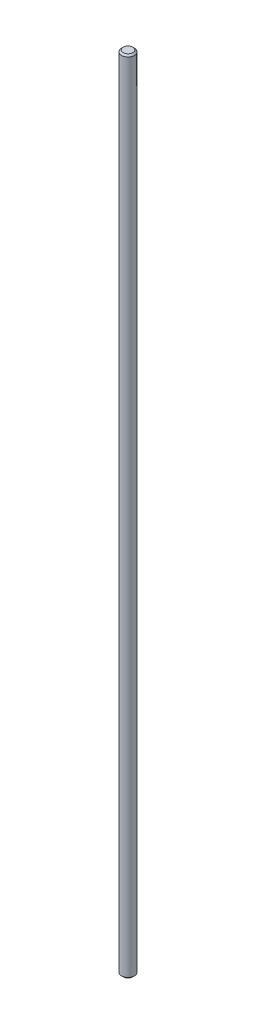
ISO-10303-21;
HEADER;
FILE_DESCRIPTION(('STEP AP214'),'2;1');
FILE_NAME('part.step','',(''),(''),'','','');
FILE_SCHEMA(('AUTOMOTIVE_DESIGN { 1 0 10303 214 1 1 1 1 }'));
ENDSEC;
DATA;
#1=APPLICATION_CONTEXT('core data for automotive mechanical design processes');
#2=APPLICATION_PROTOCOL_DEFINITION('international standard','automotive_design',2000,#1);
#3=PRODUCT_CONTEXT('',#1,'mechanical');
#4=PRODUCT('Part','Part','',(#3));
#5=PRODUCT_RELATED_PRODUCT_CATEGORY('part','',(#4));
#6=PRODUCT_DEFINITION_FORMATION('','',#4);
#7=PRODUCT_DEFINITION_CONTEXT('part definition',#1,'design');
#8=PRODUCT_DEFINITION('design','',#6,#7);
#9=PRODUCT_DEFINITION_SHAPE('','',#8);
#10=(LENGTH_UNIT() NAMED_UNIT(*) SI_UNIT(.MILLI.,.METRE.));
#11=(NAMED_UNIT(*) PLANE_ANGLE_UNIT() SI_UNIT($,.RADIAN.));
#12=(NAMED_UNIT(*) SI_UNIT($,.STERADIAN.) SOLID_ANGLE_UNIT());
#13=UNCERTAINTY_MEASURE_WITH_UNIT(LENGTH_MEASURE(1.E-05),#10,'distance_accuracy_value','');
#14=(GEOMETRIC_REPRESENTATION_CONTEXT(3) GLOBAL_UNCERTAINTY_ASSIGNED_CONTEXT((#13)) GLOBAL_UNIT_ASSIGNED_CONTEXT((#10,
#11,#12)) REPRESENTATION_CONTEXT('',''));
#15=CARTESIAN_POINT('',(0.,0.,0.));
#16=DIRECTION('',(0.,0.,1.));
#17=DIRECTION('',(1.,0.,0.));
#18=AXIS2_PLACEMENT_3D('',#15,#16,#17);
#19=CARTESIAN_POINT('',(0.,500.,0.));
#20=DIRECTION('',(0.,-1.,0.));
#21=DIRECTION('',(0.,0.,-1.));
#22=AXIS2_PLACEMENT_3D('',#19,#20,#21);
#23=CYLINDRICAL_SURFACE('',#22,4.);
#24=CARTESIAN_POINT('',(0.,499.,0.));
#25=DIRECTION('',(0.,1.,0.));
#26=DIRECTION('',(0.,0.,1.));
#27=AXIS2_PLACEMENT_3D('',#24,#25,#26);
#28=CIRCLE('',#27,4.);
#29=CARTESIAN_POINT('',(0.,499.,4.));
#30=VERTEX_POINT('',#29);
#31=EDGE_CURVE('E38',#30,#30,#28,.F.);
#32=ORIENTED_EDGE('',*,*,#31,.T.);
#33=EDGE_LOOP('',(#32));
#34=FACE_BOUND('',#33,.T.);
#35=CARTESIAN_POINT('',(0.,1.00000000000006,0.));
#36=DIRECTION('',(0.,1.,0.));
#37=DIRECTION('',(0.,0.,1.));
#38=AXIS2_PLACEMENT_3D('',#35,#36,#37);
#39=CIRCLE('',#38,4.);
#40=CARTESIAN_POINT('',(0.,1.00000000000006,4.));
#41=VERTEX_POINT('',#40);
#42=EDGE_CURVE('E42',#41,#41,#39,.T.);
#43=ORIENTED_EDGE('',*,*,#42,.T.);
#44=EDGE_LOOP('',(#43));
#45=FACE_BOUND('',#44,.T.);
#46=ADVANCED_FACE('F31',(#34,#45),#23,.T.);
#47=CARTESIAN_POINT('',(0.,500.,0.));
#48=DIRECTION('',(0.,1.,0.));
#49=DIRECTION('',(0.,0.,1.));
#50=AXIS2_PLACEMENT_3D('',#47,#48,#49);
#51=PLANE('',#50);
#52=CARTESIAN_POINT('',(0.,500.,0.));
#53=DIRECTION('',(0.,1.,0.));
#54=DIRECTION('',(0.,0.,1.));
#55=AXIS2_PLACEMENT_3D('',#52,#53,#54);
#56=CIRCLE('',#55,2.99999999999995);
#57=CARTESIAN_POINT('',(0.,500.,2.99999999999995));
#58=VERTEX_POINT('',#57);
#59=EDGE_CURVE('E46',#58,#58,#56,.T.);
#60=ORIENTED_EDGE('',*,*,#59,.T.);
#61=EDGE_LOOP('',(#60));
#62=FACE_BOUND('',#61,.T.);
#63=ADVANCED_FACE('F52',(#62),#51,.T.);
#64=CARTESIAN_POINT('',(0.,0.,0.));
#65=DIRECTION('',(0.,1.,0.));
#66=DIRECTION('',(0.,0.,1.));
#67=AXIS2_PLACEMENT_3D('',#64,#65,#66);
#68=PLANE('',#67);
#69=CARTESIAN_POINT('',(0.,0.,0.));
#70=DIRECTION('',(0.,1.,0.));
#71=DIRECTION('',(0.,0.,1.));
#72=AXIS2_PLACEMENT_3D('',#69,#70,#71);
#73=CIRCLE('',#72,3.);
#74=CARTESIAN_POINT('',(0.,0.,3.));
#75=VERTEX_POINT('',#74);
#76=EDGE_CURVE('E10',#75,#75,#73,.F.);
#77=ORIENTED_EDGE('',*,*,#76,.T.);
#78=EDGE_LOOP('',(#77));
#79=FACE_BOUND('',#78,.T.);
#80=ADVANCED_FACE('F56',(#79),#68,.F.);
#81=CARTESIAN_POINT('',(0.,500.,0.));
#82=DIRECTION('',(0.,-1.,0.));
#83=DIRECTION('',(0.,0.,-1.));
#84=AXIS2_PLACEMENT_3D('',#81,#82,#83);
#85=CONICAL_SURFACE('',#84,2.99999999999995,0.785398163397419);
#86=ORIENTED_EDGE('',*,*,#31,.F.);
#87=EDGE_LOOP('',(#86));
#88=FACE_BOUND('',#87,.T.);
#89=ORIENTED_EDGE('',*,*,#59,.F.);
#90=EDGE_LOOP('',(#89));
#91=FACE_BOUND('',#90,.T.);
#92=ADVANCED_FACE('F54',(#88,#91),#85,.T.);
#93=CARTESIAN_POINT('',(0.,1.00000000000006,0.));
#94=DIRECTION('',(0.,1.,0.));
#95=DIRECTION('',(0.,0.,1.));
#96=AXIS2_PLACEMENT_3D('',#93,#94,#95);
#97=CONICAL_SURFACE('',#96,4.,0.785398163397419);
#98=ORIENTED_EDGE('',*,*,#76,.F.);
#99=EDGE_LOOP('',(#98));
#100=FACE_BOUND('',#99,.T.);
#101=ORIENTED_EDGE('',*,*,#42,.F.);
#102=EDGE_LOOP('',(#101));
#103=FACE_BOUND('',#102,.T.);
#104=ADVANCED_FACE('F33',(#100,#103),#97,.T.);
#105=CLOSED_SHELL('',(#46,#63,#80,#92,#104));
#106=MANIFOLD_SOLID_BREP('B2',#105);
#107=ADVANCED_BREP_SHAPE_REPRESENTATION('',(#18,#106),#14);
#108=SHAPE_DEFINITION_REPRESENTATION(#9,#107);
ENDSEC;
END-ISO-10303-21;
